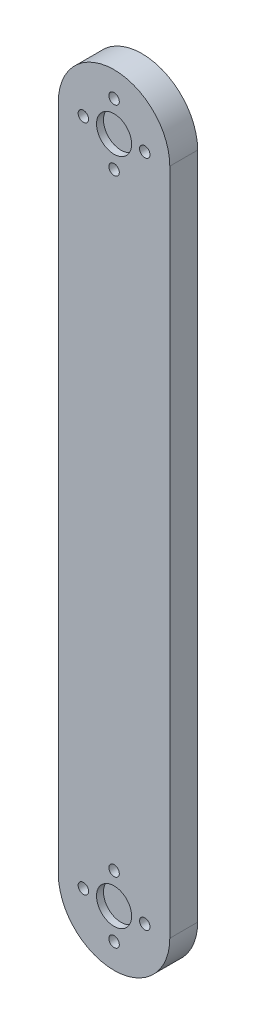
ISO-10303-21;
HEADER;
FILE_DESCRIPTION(('STEP AP214'),'2;1');
FILE_NAME('part.step','',(''),(''),'','','');
FILE_SCHEMA(('AUTOMOTIVE_DESIGN { 1 0 10303 214 1 1 1 1 }'));
ENDSEC;
DATA;
#1=APPLICATION_CONTEXT('core data for automotive mechanical design processes');
#2=APPLICATION_PROTOCOL_DEFINITION('international standard','automotive_design',2000,#1);
#3=PRODUCT_CONTEXT('',#1,'mechanical');
#4=PRODUCT('Part','Part','',(#3));
#5=PRODUCT_RELATED_PRODUCT_CATEGORY('part','',(#4));
#6=PRODUCT_DEFINITION_FORMATION('','',#4);
#7=PRODUCT_DEFINITION_CONTEXT('part definition',#1,'design');
#8=PRODUCT_DEFINITION('design','',#6,#7);
#9=PRODUCT_DEFINITION_SHAPE('','',#8);
#10=(LENGTH_UNIT() NAMED_UNIT(*) SI_UNIT(.MILLI.,.METRE.));
#11=(NAMED_UNIT(*) PLANE_ANGLE_UNIT() SI_UNIT($,.RADIAN.));
#12=(NAMED_UNIT(*) SI_UNIT($,.STERADIAN.) SOLID_ANGLE_UNIT());
#13=UNCERTAINTY_MEASURE_WITH_UNIT(LENGTH_MEASURE(1.E-05),#10,'distance_accuracy_value','');
#14=(GEOMETRIC_REPRESENTATION_CONTEXT(3) GLOBAL_UNCERTAINTY_ASSIGNED_CONTEXT((#13)) GLOBAL_UNIT_ASSIGNED_CONTEXT((#10,
#11,#12)) REPRESENTATION_CONTEXT('',''));
#15=CARTESIAN_POINT('',(0.,0.,0.));
#16=DIRECTION('',(0.,0.,1.));
#17=DIRECTION('',(1.,0.,0.));
#18=AXIS2_PLACEMENT_3D('',#15,#16,#17);
#19=CARTESIAN_POINT('',(0.,-76.2,6.35));
#20=DIRECTION('',(0.,0.,-1.));
#21=DIRECTION('',(-1.,0.,0.));
#22=AXIS2_PLACEMENT_3D('',#19,#20,#21);
#23=CYLINDRICAL_SURFACE('',#22,12.7);
#24=CARTESIAN_POINT('',(0.,-76.2,0.));
#25=DIRECTION('',(0.,0.,1.));
#26=DIRECTION('',(1.,0.,0.));
#27=AXIS2_PLACEMENT_3D('',#24,#25,#26);
#28=CIRCLE('',#27,12.7);
#29=CARTESIAN_POINT('',(-12.7,-76.2,0.));
#30=VERTEX_POINT('',#29);
#31=CARTESIAN_POINT('',(12.7,-76.2,0.));
#32=VERTEX_POINT('',#31);
#33=EDGE_CURVE('E95',#30,#32,#28,.T.);
#34=ORIENTED_EDGE('',*,*,#33,.T.);
#35=DIRECTION('',(0.,0.,-1.));
#36=VECTOR('',#35,1.);
#37=CARTESIAN_POINT('',(12.7,-76.2,6.35));
#38=LINE('',#37,#36);
#39=CARTESIAN_POINT('',(12.7,-76.2,6.35));
#40=VERTEX_POINT('',#39);
#41=EDGE_CURVE('E11',#40,#32,#38,.T.);
#42=ORIENTED_EDGE('',*,*,#41,.F.);
#43=CARTESIAN_POINT('',(0.,-76.2,6.35));
#44=DIRECTION('',(0.,0.,1.));
#45=DIRECTION('',(1.,0.,0.));
#46=AXIS2_PLACEMENT_3D('',#43,#44,#45);
#47=CIRCLE('',#46,12.7);
#48=CARTESIAN_POINT('',(-12.7,-76.2,6.35));
#49=VERTEX_POINT('',#48);
#50=EDGE_CURVE('E83',#49,#40,#47,.T.);
#51=ORIENTED_EDGE('',*,*,#50,.F.);
#52=DIRECTION('',(0.,0.,-1.));
#53=VECTOR('',#52,1.);
#54=CARTESIAN_POINT('',(-12.7,-76.2,6.35));
#55=LINE('',#54,#53);
#56=EDGE_CURVE('E91',#49,#30,#55,.T.);
#57=ORIENTED_EDGE('',*,*,#56,.T.);
#58=EDGE_LOOP('',(#34,#42,#51,#57));
#59=FACE_BOUND('',#58,.T.);
#60=ADVANCED_FACE('F32',(#59),#23,.T.);
#61=CARTESIAN_POINT('',(12.7,-76.2,6.35));
#62=DIRECTION('',(-1.,0.,0.));
#63=DIRECTION('',(0.,-1.,0.));
#64=AXIS2_PLACEMENT_3D('',#61,#62,#63);
#65=PLANE('',#64);
#66=DIRECTION('',(0.,1.,0.));
#67=VECTOR('',#66,1.);
#68=CARTESIAN_POINT('',(12.7,-76.2,0.));
#69=LINE('',#68,#67);
#70=CARTESIAN_POINT('',(12.7,76.2,0.));
#71=VERTEX_POINT('',#70);
#72=EDGE_CURVE('E87',#32,#71,#69,.T.);
#73=ORIENTED_EDGE('',*,*,#72,.T.);
#74=DIRECTION('',(0.,0.,-1.));
#75=VECTOR('',#74,1.);
#76=CARTESIAN_POINT('',(12.7,76.2,6.35));
#77=LINE('',#76,#75);
#78=CARTESIAN_POINT('',(12.7,76.2,6.35));
#79=VERTEX_POINT('',#78);
#80=EDGE_CURVE('E40',#79,#71,#77,.T.);
#81=ORIENTED_EDGE('',*,*,#80,.F.);
#82=DIRECTION('',(0.,1.,0.));
#83=VECTOR('',#82,1.);
#84=CARTESIAN_POINT('',(12.7,-76.2,6.35));
#85=LINE('',#84,#83);
#86=EDGE_CURVE('E78',#40,#79,#85,.T.);
#87=ORIENTED_EDGE('',*,*,#86,.F.);
#88=ORIENTED_EDGE('',*,*,#41,.T.);
#89=EDGE_LOOP('',(#73,#81,#87,#88));
#90=FACE_BOUND('',#89,.T.);
#91=ADVANCED_FACE('F86',(#90),#65,.F.);
#92=CARTESIAN_POINT('',(0.,76.2,6.35));
#93=DIRECTION('',(0.,0.,-1.));
#94=DIRECTION('',(-1.,0.,0.));
#95=AXIS2_PLACEMENT_3D('',#92,#93,#94);
#96=CYLINDRICAL_SURFACE('',#95,12.7);
#97=CARTESIAN_POINT('',(0.,76.2,0.));
#98=DIRECTION('',(0.,0.,1.));
#99=DIRECTION('',(1.,0.,0.));
#100=AXIS2_PLACEMENT_3D('',#97,#98,#99);
#101=CIRCLE('',#100,12.7);
#102=CARTESIAN_POINT('',(-12.7000000000001,76.2,0.));
#103=VERTEX_POINT('',#102);
#104=EDGE_CURVE('E65',#71,#103,#101,.T.);
#105=ORIENTED_EDGE('',*,*,#104,.T.);
#106=DIRECTION('',(0.,0.,-1.));
#107=VECTOR('',#106,1.);
#108=CARTESIAN_POINT('',(-12.7000000000001,76.2,6.35));
#109=LINE('',#108,#107);
#110=CARTESIAN_POINT('',(-12.7000000000001,76.2,6.35));
#111=VERTEX_POINT('',#110);
#112=EDGE_CURVE('E88',#111,#103,#109,.T.);
#113=ORIENTED_EDGE('',*,*,#112,.F.);
#114=CARTESIAN_POINT('',(0.,76.2,6.35));
#115=DIRECTION('',(0.,0.,1.));
#116=DIRECTION('',(1.,0.,0.));
#117=AXIS2_PLACEMENT_3D('',#114,#115,#116);
#118=CIRCLE('',#117,12.7);
#119=EDGE_CURVE('E81',#79,#111,#118,.T.);
#120=ORIENTED_EDGE('',*,*,#119,.F.);
#121=ORIENTED_EDGE('',*,*,#80,.T.);
#122=EDGE_LOOP('',(#105,#113,#120,#121));
#123=FACE_BOUND('',#122,.T.);
#124=ADVANCED_FACE('F89',(#123),#96,.T.);
#125=CARTESIAN_POINT('',(-12.7,-76.2,6.35));
#126=DIRECTION('',(1.,0.,0.));
#127=DIRECTION('',(0.,1.,0.));
#128=AXIS2_PLACEMENT_3D('',#125,#126,#127);
#129=PLANE('',#128);
#130=DIRECTION('',(0.,-1.,0.));
#131=VECTOR('',#130,1.);
#132=CARTESIAN_POINT('',(-12.7,-76.2,0.));
#133=LINE('',#132,#131);
#134=EDGE_CURVE('E71',#103,#30,#133,.T.);
#135=ORIENTED_EDGE('',*,*,#134,.T.);
#136=ORIENTED_EDGE('',*,*,#56,.F.);
#137=DIRECTION('',(0.,-1.,0.));
#138=VECTOR('',#137,1.);
#139=CARTESIAN_POINT('',(-12.7,-76.2,6.35));
#140=LINE('',#139,#138);
#141=EDGE_CURVE('E48',#111,#49,#140,.T.);
#142=ORIENTED_EDGE('',*,*,#141,.F.);
#143=ORIENTED_EDGE('',*,*,#112,.T.);
#144=EDGE_LOOP('',(#135,#136,#142,#143));
#145=FACE_BOUND('',#144,.T.);
#146=ADVANCED_FACE('F103',(#145),#129,.F.);
#147=CARTESIAN_POINT('',(0.,-76.2,6.35));
#148=DIRECTION('',(0.,0.,1.));
#149=DIRECTION('',(1.,0.,0.));
#150=AXIS2_PLACEMENT_3D('',#147,#148,#149);
#151=PLANE('',#150);
#152=CARTESIAN_POINT('',(-7.00000000000001,-76.1999999999999,6.35));
#153=DIRECTION('',(0.,0.,1.));
#154=DIRECTION('',(0.,1.,0.));
#155=AXIS2_PLACEMENT_3D('',#152,#153,#154);
#156=CIRCLE('',#155,1.190625);
#157=CARTESIAN_POINT('',(-6.99999999999999,-75.0093749999999,6.35));
#158=VERTEX_POINT('',#157);
#159=EDGE_CURVE('E165',#158,#158,#156,.T.);
#160=ORIENTED_EDGE('',*,*,#159,.F.);
#161=EDGE_LOOP('',(#160));
#162=FACE_BOUND('',#161,.T.);
#163=CARTESIAN_POINT('',(0.,-83.2,6.35));
#164=DIRECTION('',(0.,0.,1.));
#165=DIRECTION('',(-1.,0.,0.));
#166=AXIS2_PLACEMENT_3D('',#163,#164,#165);
#167=CIRCLE('',#166,1.190625);
#168=CARTESIAN_POINT('',(-1.19062499999997,-83.2,6.35));
#169=VERTEX_POINT('',#168);
#170=EDGE_CURVE('E159',#169,#169,#167,.T.);
#171=ORIENTED_EDGE('',*,*,#170,.F.);
#172=EDGE_LOOP('',(#171));
#173=FACE_BOUND('',#172,.T.);
#174=CARTESIAN_POINT('',(7.00000000000001,-76.2,6.35));
#175=DIRECTION('',(0.,0.,1.));
#176=DIRECTION('',(0.,-1.,0.));
#177=AXIS2_PLACEMENT_3D('',#174,#175,#176);
#178=CIRCLE('',#177,1.190625);
#179=CARTESIAN_POINT('',(7.,-77.390625,6.35));
#180=VERTEX_POINT('',#179);
#181=EDGE_CURVE('E153',#180,#180,#178,.T.);
#182=ORIENTED_EDGE('',*,*,#181,.F.);
#183=EDGE_LOOP('',(#182));
#184=FACE_BOUND('',#183,.T.);
#185=CARTESIAN_POINT('',(0.,69.2,6.35));
#186=DIRECTION('',(0.,0.,1.));
#187=DIRECTION('',(-1.,0.,0.));
#188=AXIS2_PLACEMENT_3D('',#185,#186,#187);
#189=CIRCLE('',#188,1.190625);
#190=CARTESIAN_POINT('',(-1.19062500000003,69.2,6.35));
#191=VERTEX_POINT('',#190);
#192=EDGE_CURVE('E141',#191,#191,#189,.T.);
#193=ORIENTED_EDGE('',*,*,#192,.F.);
#194=EDGE_LOOP('',(#193));
#195=FACE_BOUND('',#194,.T.);
#196=CARTESIAN_POINT('',(-7.00000000000003,76.2000000000001,6.35));
#197=DIRECTION('',(0.,0.,1.));
#198=DIRECTION('',(0.,1.,0.));
#199=AXIS2_PLACEMENT_3D('',#196,#197,#198);
#200=CIRCLE('',#199,1.190625);
#201=CARTESIAN_POINT('',(-7.00000000000002,77.3906250000001,6.35));
#202=VERTEX_POINT('',#201);
#203=EDGE_CURVE('E147',#202,#202,#200,.T.);
#204=ORIENTED_EDGE('',*,*,#203,.F.);
#205=EDGE_LOOP('',(#204));
#206=FACE_BOUND('',#205,.T.);
#207=CARTESIAN_POINT('',(6.99999999999998,76.2,6.35));
#208=DIRECTION('',(0.,0.,1.));
#209=DIRECTION('',(0.,-1.,0.));
#210=AXIS2_PLACEMENT_3D('',#207,#208,#209);
#211=CIRCLE('',#210,1.190625);
#212=CARTESIAN_POINT('',(6.99999999999997,75.009375,6.35));
#213=VERTEX_POINT('',#212);
#214=EDGE_CURVE('E135',#213,#213,#211,.T.);
#215=ORIENTED_EDGE('',*,*,#214,.F.);
#216=EDGE_LOOP('',(#215));
#217=FACE_BOUND('',#216,.T.);
#218=CARTESIAN_POINT('',(0.,83.2,6.35));
#219=DIRECTION('',(0.,0.,1.));
#220=DIRECTION('',(1.,0.,0.));
#221=AXIS2_PLACEMENT_3D('',#218,#219,#220);
#222=CIRCLE('',#221,1.190625);
#223=CARTESIAN_POINT('',(1.19062499999997,83.2,6.35));
#224=VERTEX_POINT('',#223);
#225=EDGE_CURVE('E124',#224,#224,#222,.T.);
#226=ORIENTED_EDGE('',*,*,#225,.F.);
#227=EDGE_LOOP('',(#226));
#228=FACE_BOUND('',#227,.T.);
#229=CARTESIAN_POINT('',(0.,-69.2,6.35));
#230=DIRECTION('',(0.,0.,1.));
#231=DIRECTION('',(1.,0.,0.));
#232=AXIS2_PLACEMENT_3D('',#229,#230,#231);
#233=CIRCLE('',#232,1.190625);
#234=CARTESIAN_POINT('',(1.19062499999997,-69.2,6.35));
#235=VERTEX_POINT('',#234);
#236=EDGE_CURVE('E125',#235,#235,#233,.T.);
#237=ORIENTED_EDGE('',*,*,#236,.F.);
#238=EDGE_LOOP('',(#237));
#239=FACE_BOUND('',#238,.T.);
#240=CARTESIAN_POINT('',(0.,-76.2,6.35));
#241=DIRECTION('',(0.,0.,-1.));
#242=DIRECTION('',(1.,0.,0.));
#243=AXIS2_PLACEMENT_3D('',#240,#241,#242);
#244=CIRCLE('',#243,4.);
#245=CARTESIAN_POINT('',(3.99999999999997,-76.2,6.35));
#246=VERTEX_POINT('',#245);
#247=EDGE_CURVE('E115',#246,#246,#244,.T.);
#248=ORIENTED_EDGE('',*,*,#247,.T.);
#249=EDGE_LOOP('',(#248));
#250=FACE_BOUND('',#249,.T.);
#251=CARTESIAN_POINT('',(0.,76.2,6.35));
#252=DIRECTION('',(0.,0.,1.));
#253=DIRECTION('',(1.,0.,0.));
#254=AXIS2_PLACEMENT_3D('',#251,#252,#253);
#255=CIRCLE('',#254,4.);
#256=CARTESIAN_POINT('',(3.99999999999997,76.2,6.35));
#257=VERTEX_POINT('',#256);
#258=EDGE_CURVE('E109',#257,#257,#255,.T.);
#259=ORIENTED_EDGE('',*,*,#258,.F.);
#260=EDGE_LOOP('',(#259));
#261=FACE_BOUND('',#260,.T.);
#262=ORIENTED_EDGE('',*,*,#50,.T.);
#263=ORIENTED_EDGE('',*,*,#86,.T.);
#264=ORIENTED_EDGE('',*,*,#119,.T.);
#265=ORIENTED_EDGE('',*,*,#141,.T.);
#266=EDGE_LOOP('',(#262,#263,#264,#265));
#267=FACE_BOUND('',#266,.T.);
#268=ADVANCED_FACE('F79',(#162,#173,#184,#195,#206,#217,#228,#239,#250,#261,#267),#151,.T.);
#269=CARTESIAN_POINT('',(0.,-76.2,0.));
#270=DIRECTION('',(0.,0.,1.));
#271=DIRECTION('',(1.,0.,0.));
#272=AXIS2_PLACEMENT_3D('',#269,#270,#271);
#273=PLANE('',#272);
#274=CARTESIAN_POINT('',(-7.00000000000001,-76.1999999999999,0.));
#275=DIRECTION('',(0.,0.,1.));
#276=DIRECTION('',(1.,0.,0.));
#277=AXIS2_PLACEMENT_3D('',#274,#275,#276);
#278=CIRCLE('',#277,1.190625);
#279=CARTESIAN_POINT('',(-5.80937500000001,-76.1999999999999,0.));
#280=VERTEX_POINT('',#279);
#281=EDGE_CURVE('E162',#280,#280,#278,.F.);
#282=ORIENTED_EDGE('',*,*,#281,.F.);
#283=EDGE_LOOP('',(#282));
#284=FACE_BOUND('',#283,.T.);
#285=CARTESIAN_POINT('',(0.,-83.2,0.));
#286=DIRECTION('',(0.,0.,1.));
#287=DIRECTION('',(1.,0.,0.));
#288=AXIS2_PLACEMENT_3D('',#285,#286,#287);
#289=CIRCLE('',#288,1.190625);
#290=CARTESIAN_POINT('',(1.19062500000003,-83.2,0.));
#291=VERTEX_POINT('',#290);
#292=EDGE_CURVE('E156',#291,#291,#289,.F.);
#293=ORIENTED_EDGE('',*,*,#292,.F.);
#294=EDGE_LOOP('',(#293));
#295=FACE_BOUND('',#294,.T.);
#296=CARTESIAN_POINT('',(7.00000000000001,-76.2,0.));
#297=DIRECTION('',(0.,0.,1.));
#298=DIRECTION('',(1.,0.,0.));
#299=AXIS2_PLACEMENT_3D('',#296,#297,#298);
#300=CIRCLE('',#299,1.190625);
#301=CARTESIAN_POINT('',(8.19062500000001,-76.2,0.));
#302=VERTEX_POINT('',#301);
#303=EDGE_CURVE('E150',#302,#302,#300,.F.);
#304=ORIENTED_EDGE('',*,*,#303,.F.);
#305=EDGE_LOOP('',(#304));
#306=FACE_BOUND('',#305,.T.);
#307=CARTESIAN_POINT('',(0.,69.2,0.));
#308=DIRECTION('',(0.,0.,1.));
#309=DIRECTION('',(1.,0.,0.));
#310=AXIS2_PLACEMENT_3D('',#307,#308,#309);
#311=CIRCLE('',#310,1.190625);
#312=CARTESIAN_POINT('',(1.19062499999997,69.2,0.));
#313=VERTEX_POINT('',#312);
#314=EDGE_CURVE('E138',#313,#313,#311,.F.);
#315=ORIENTED_EDGE('',*,*,#314,.F.);
#316=EDGE_LOOP('',(#315));
#317=FACE_BOUND('',#316,.T.);
#318=CARTESIAN_POINT('',(-7.00000000000003,76.2000000000001,0.));
#319=DIRECTION('',(0.,0.,1.));
#320=DIRECTION('',(1.,0.,0.));
#321=AXIS2_PLACEMENT_3D('',#318,#319,#320);
#322=CIRCLE('',#321,1.190625);
#323=CARTESIAN_POINT('',(-5.80937500000003,76.2000000000001,0.));
#324=VERTEX_POINT('',#323);
#325=EDGE_CURVE('E144',#324,#324,#322,.F.);
#326=ORIENTED_EDGE('',*,*,#325,.F.);
#327=EDGE_LOOP('',(#326));
#328=FACE_BOUND('',#327,.T.);
#329=CARTESIAN_POINT('',(6.99999999999998,76.2,0.));
#330=DIRECTION('',(0.,0.,1.));
#331=DIRECTION('',(1.,0.,0.));
#332=AXIS2_PLACEMENT_3D('',#329,#330,#331);
#333=CIRCLE('',#332,1.190625);
#334=CARTESIAN_POINT('',(8.19062499999998,76.2,0.));
#335=VERTEX_POINT('',#334);
#336=EDGE_CURVE('E128',#335,#335,#333,.F.);
#337=ORIENTED_EDGE('',*,*,#336,.F.);
#338=EDGE_LOOP('',(#337));
#339=FACE_BOUND('',#338,.T.);
#340=CARTESIAN_POINT('',(0.,83.2,0.));
#341=DIRECTION('',(0.,0.,1.));
#342=DIRECTION('',(1.,0.,0.));
#343=AXIS2_PLACEMENT_3D('',#340,#341,#342);
#344=CIRCLE('',#343,1.190625);
#345=CARTESIAN_POINT('',(1.19062499999997,83.2,0.));
#346=VERTEX_POINT('',#345);
#347=EDGE_CURVE('E118',#346,#346,#344,.F.);
#348=ORIENTED_EDGE('',*,*,#347,.F.);
#349=EDGE_LOOP('',(#348));
#350=FACE_BOUND('',#349,.T.);
#351=CARTESIAN_POINT('',(0.,-69.2,0.));
#352=DIRECTION('',(0.,0.,1.));
#353=DIRECTION('',(1.,0.,0.));
#354=AXIS2_PLACEMENT_3D('',#351,#352,#353);
#355=CIRCLE('',#354,1.190625);
#356=CARTESIAN_POINT('',(1.19062499999997,-69.2,0.));
#357=VERTEX_POINT('',#356);
#358=EDGE_CURVE('E121',#357,#357,#355,.F.);
#359=ORIENTED_EDGE('',*,*,#358,.F.);
#360=EDGE_LOOP('',(#359));
#361=FACE_BOUND('',#360,.T.);
#362=ORIENTED_EDGE('',*,*,#33,.F.);
#363=ORIENTED_EDGE('',*,*,#134,.F.);
#364=ORIENTED_EDGE('',*,*,#104,.F.);
#365=ORIENTED_EDGE('',*,*,#72,.F.);
#366=EDGE_LOOP('',(#362,#363,#364,#365));
#367=FACE_BOUND('',#366,.T.);
#368=ADVANCED_FACE('F106',(#284,#295,#306,#317,#328,#339,#350,#361,#367),#273,.F.);
#369=CARTESIAN_POINT('',(0.,76.2,4.7625));
#370=DIRECTION('',(0.,0.,1.));
#371=DIRECTION('',(1.,0.,0.));
#372=AXIS2_PLACEMENT_3D('',#369,#370,#371);
#373=CYLINDRICAL_SURFACE('',#372,4.);
#374=CARTESIAN_POINT('',(0.,76.2,4.7625));
#375=DIRECTION('',(0.,0.,1.));
#376=DIRECTION('',(1.,0.,0.));
#377=AXIS2_PLACEMENT_3D('',#374,#375,#376);
#378=CIRCLE('',#377,4.);
#379=CARTESIAN_POINT('',(3.99999999999997,76.2,4.7625));
#380=VERTEX_POINT('',#379);
#381=EDGE_CURVE('E98',#380,#380,#378,.T.);
#382=ORIENTED_EDGE('',*,*,#381,.F.);
#383=EDGE_LOOP('',(#382));
#384=FACE_BOUND('',#383,.T.);
#385=ORIENTED_EDGE('',*,*,#258,.T.);
#386=EDGE_LOOP('',(#385));
#387=FACE_BOUND('',#386,.T.);
#388=ADVANCED_FACE('F192',(#384,#387),#373,.F.);
#389=CARTESIAN_POINT('',(0.,76.2,4.7625));
#390=DIRECTION('',(0.,0.,1.));
#391=DIRECTION('',(1.,0.,0.));
#392=AXIS2_PLACEMENT_3D('',#389,#390,#391);
#393=PLANE('',#392);
#394=ORIENTED_EDGE('',*,*,#381,.T.);
#395=EDGE_LOOP('',(#394));
#396=FACE_BOUND('',#395,.T.);
#397=ADVANCED_FACE('F194',(#396),#393,.T.);
#398=CARTESIAN_POINT('',(0.,-76.2,4.7625));
#399=DIRECTION('',(0.,0.,1.));
#400=DIRECTION('',(1.,0.,0.));
#401=AXIS2_PLACEMENT_3D('',#398,#399,#400);
#402=CYLINDRICAL_SURFACE('',#401,4.);
#403=CARTESIAN_POINT('',(0.,-76.2,4.7625));
#404=DIRECTION('',(0.,0.,-1.));
#405=DIRECTION('',(1.,0.,0.));
#406=AXIS2_PLACEMENT_3D('',#403,#404,#405);
#407=CIRCLE('',#406,4.);
#408=CARTESIAN_POINT('',(3.99999999999997,-76.2,4.7625));
#409=VERTEX_POINT('',#408);
#410=EDGE_CURVE('E112',#409,#409,#407,.T.);
#411=ORIENTED_EDGE('',*,*,#410,.T.);
#412=EDGE_LOOP('',(#411));
#413=FACE_BOUND('',#412,.T.);
#414=ORIENTED_EDGE('',*,*,#247,.F.);
#415=EDGE_LOOP('',(#414));
#416=FACE_BOUND('',#415,.T.);
#417=ADVANCED_FACE('F201',(#413,#416),#402,.F.);
#418=CARTESIAN_POINT('',(0.,-76.2,4.7625));
#419=DIRECTION('',(0.,0.,1.));
#420=DIRECTION('',(1.,0.,0.));
#421=AXIS2_PLACEMENT_3D('',#418,#419,#420);
#422=PLANE('',#421);
#423=ORIENTED_EDGE('',*,*,#410,.F.);
#424=EDGE_LOOP('',(#423));
#425=FACE_BOUND('',#424,.T.);
#426=ADVANCED_FACE('F285',(#425),#422,.T.);
#427=CARTESIAN_POINT('',(0.,-69.2,-3.36759604540093));
#428=DIRECTION('',(0.,0.,1.));
#429=DIRECTION('',(1.,0.,0.));
#430=AXIS2_PLACEMENT_3D('',#427,#428,#429);
#431=CYLINDRICAL_SURFACE('',#430,1.190625);
#432=ORIENTED_EDGE('',*,*,#358,.T.);
#433=EDGE_LOOP('',(#432));
#434=FACE_BOUND('',#433,.T.);
#435=ORIENTED_EDGE('',*,*,#236,.T.);
#436=EDGE_LOOP('',(#435));
#437=FACE_BOUND('',#436,.T.);
#438=ADVANCED_FACE('F281',(#434,#437),#431,.F.);
#439=CARTESIAN_POINT('',(0.,83.2,-3.36759604540093));
#440=DIRECTION('',(0.,0.,1.));
#441=DIRECTION('',(1.,0.,0.));
#442=AXIS2_PLACEMENT_3D('',#439,#440,#441);
#443=CYLINDRICAL_SURFACE('',#442,1.190625);
#444=ORIENTED_EDGE('',*,*,#347,.T.);
#445=EDGE_LOOP('',(#444));
#446=FACE_BOUND('',#445,.T.);
#447=ORIENTED_EDGE('',*,*,#225,.T.);
#448=EDGE_LOOP('',(#447));
#449=FACE_BOUND('',#448,.T.);
#450=ADVANCED_FACE('F277',(#446,#449),#443,.F.);
#451=CARTESIAN_POINT('',(6.99999999999998,76.2,-3.36759604540093));
#452=DIRECTION('',(0.,0.,1.));
#453=DIRECTION('',(1.,0.,0.));
#454=AXIS2_PLACEMENT_3D('',#451,#452,#453);
#455=CYLINDRICAL_SURFACE('',#454,1.190625);
#456=ORIENTED_EDGE('',*,*,#336,.T.);
#457=EDGE_LOOP('',(#456));
#458=FACE_BOUND('',#457,.T.);
#459=ORIENTED_EDGE('',*,*,#214,.T.);
#460=EDGE_LOOP('',(#459));
#461=FACE_BOUND('',#460,.T.);
#462=ADVANCED_FACE('F271',(#458,#461),#455,.F.);
#463=CARTESIAN_POINT('',(-7.00000000000003,76.2000000000001,-3.36759604540093));
#464=DIRECTION('',(0.,0.,1.));
#465=DIRECTION('',(1.,0.,0.));
#466=AXIS2_PLACEMENT_3D('',#463,#464,#465);
#467=CYLINDRICAL_SURFACE('',#466,1.190625);
#468=ORIENTED_EDGE('',*,*,#325,.T.);
#469=EDGE_LOOP('',(#468));
#470=FACE_BOUND('',#469,.T.);
#471=ORIENTED_EDGE('',*,*,#203,.T.);
#472=EDGE_LOOP('',(#471));
#473=FACE_BOUND('',#472,.T.);
#474=ADVANCED_FACE('F268',(#470,#473),#467,.F.);
#475=CARTESIAN_POINT('',(0.,69.2,-3.36759604540093));
#476=DIRECTION('',(0.,0.,1.));
#477=DIRECTION('',(1.,0.,0.));
#478=AXIS2_PLACEMENT_3D('',#475,#476,#477);
#479=CYLINDRICAL_SURFACE('',#478,1.190625);
#480=ORIENTED_EDGE('',*,*,#314,.T.);
#481=EDGE_LOOP('',(#480));
#482=FACE_BOUND('',#481,.T.);
#483=ORIENTED_EDGE('',*,*,#192,.T.);
#484=EDGE_LOOP('',(#483));
#485=FACE_BOUND('',#484,.T.);
#486=ADVANCED_FACE('F242',(#482,#485),#479,.F.);
#487=CARTESIAN_POINT('',(7.00000000000001,-76.2,-3.36759604540093));
#488=DIRECTION('',(0.,0.,1.));
#489=DIRECTION('',(1.,0.,0.));
#490=AXIS2_PLACEMENT_3D('',#487,#488,#489);
#491=CYLINDRICAL_SURFACE('',#490,1.190625);
#492=ORIENTED_EDGE('',*,*,#303,.T.);
#493=EDGE_LOOP('',(#492));
#494=FACE_BOUND('',#493,.T.);
#495=ORIENTED_EDGE('',*,*,#181,.T.);
#496=EDGE_LOOP('',(#495));
#497=FACE_BOUND('',#496,.T.);
#498=ADVANCED_FACE('F236',(#494,#497),#491,.F.);
#499=CARTESIAN_POINT('',(0.,-83.2,-3.36759604540093));
#500=DIRECTION('',(0.,0.,1.));
#501=DIRECTION('',(1.,0.,0.));
#502=AXIS2_PLACEMENT_3D('',#499,#500,#501);
#503=CYLINDRICAL_SURFACE('',#502,1.190625);
#504=ORIENTED_EDGE('',*,*,#292,.T.);
#505=EDGE_LOOP('',(#504));
#506=FACE_BOUND('',#505,.T.);
#507=ORIENTED_EDGE('',*,*,#170,.T.);
#508=EDGE_LOOP('',(#507));
#509=FACE_BOUND('',#508,.T.);
#510=ADVANCED_FACE('F241',(#506,#509),#503,.F.);
#511=CARTESIAN_POINT('',(-7.00000000000001,-76.1999999999999,-3.36759604540093));
#512=DIRECTION('',(0.,0.,1.));
#513=DIRECTION('',(1.,0.,0.));
#514=AXIS2_PLACEMENT_3D('',#511,#512,#513);
#515=CYLINDRICAL_SURFACE('',#514,1.190625);
#516=ORIENTED_EDGE('',*,*,#281,.T.);
#517=EDGE_LOOP('',(#516));
#518=FACE_BOUND('',#517,.T.);
#519=ORIENTED_EDGE('',*,*,#159,.T.);
#520=EDGE_LOOP('',(#519));
#521=FACE_BOUND('',#520,.T.);
#522=ADVANCED_FACE('F169',(#518,#521),#515,.F.);
#523=CLOSED_SHELL('',(#60,#91,#124,#146,#268,#368,#388,#397,#417,#426,#438,#450,#462,#474,#486,
#498,#510,#522));
#524=MANIFOLD_SOLID_BREP('B2',#523);
#525=ADVANCED_BREP_SHAPE_REPRESENTATION('',(#18,#524),#14);
#526=SHAPE_DEFINITION_REPRESENTATION(#9,#525);
ENDSEC;
END-ISO-10303-21;
